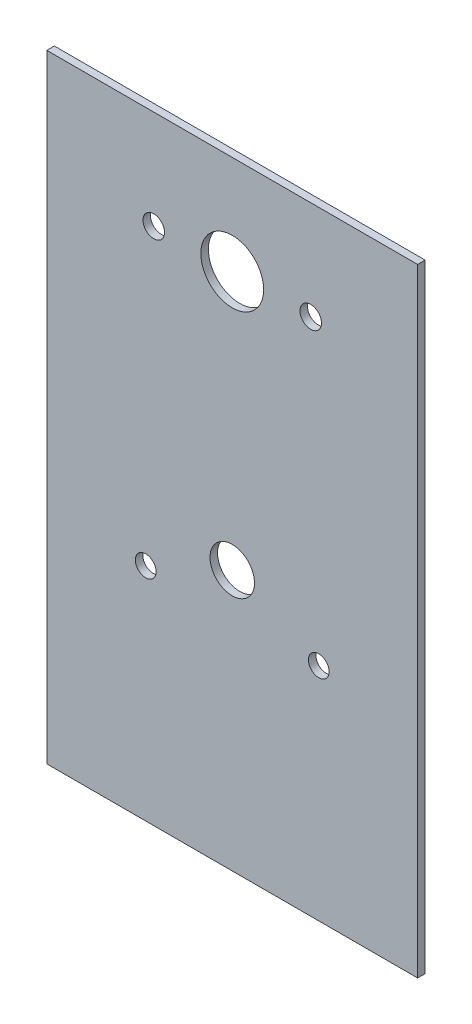
ISO-10303-21;
HEADER;
FILE_DESCRIPTION(('STEP AP214'),'2;1');
FILE_NAME('part.step','',(''),(''),'','','');
FILE_SCHEMA(('AUTOMOTIVE_DESIGN { 1 0 10303 214 1 1 1 1 }'));
ENDSEC;
DATA;
#1=APPLICATION_CONTEXT('core data for automotive mechanical design processes');
#2=APPLICATION_PROTOCOL_DEFINITION('international standard','automotive_design',2000,#1);
#3=PRODUCT_CONTEXT('',#1,'mechanical');
#4=PRODUCT('Part','Part','',(#3));
#5=PRODUCT_RELATED_PRODUCT_CATEGORY('part','',(#4));
#6=PRODUCT_DEFINITION_FORMATION('','',#4);
#7=PRODUCT_DEFINITION_CONTEXT('part definition',#1,'design');
#8=PRODUCT_DEFINITION('design','',#6,#7);
#9=PRODUCT_DEFINITION_SHAPE('','',#8);
#10=(LENGTH_UNIT() NAMED_UNIT(*) SI_UNIT(.MILLI.,.METRE.));
#11=(NAMED_UNIT(*) PLANE_ANGLE_UNIT() SI_UNIT($,.RADIAN.));
#12=(NAMED_UNIT(*) SI_UNIT($,.STERADIAN.) SOLID_ANGLE_UNIT());
#13=UNCERTAINTY_MEASURE_WITH_UNIT(LENGTH_MEASURE(1.E-05),#10,'distance_accuracy_value','');
#14=(GEOMETRIC_REPRESENTATION_CONTEXT(3) GLOBAL_UNCERTAINTY_ASSIGNED_CONTEXT((#13)) GLOBAL_UNIT_ASSIGNED_CONTEXT((#10,
#11,#12)) REPRESENTATION_CONTEXT('',''));
#15=CARTESIAN_POINT('',(0.,0.,0.));
#16=DIRECTION('',(0.,0.,1.));
#17=DIRECTION('',(1.,0.,0.));
#18=AXIS2_PLACEMENT_3D('',#15,#16,#17);
#19=CARTESIAN_POINT('',(37.5,0.,1.524));
#20=DIRECTION('',(1.,0.,0.));
#21=DIRECTION('',(0.,0.,-1.));
#22=AXIS2_PLACEMENT_3D('',#19,#20,#21);
#23=PLANE('',#22);
#24=DIRECTION('',(0.,-1.,0.));
#25=VECTOR('',#24,1.);
#26=CARTESIAN_POINT('',(37.5,0.,0.));
#27=LINE('',#26,#25);
#28=CARTESIAN_POINT('',(37.5,20.,0.));
#29=VERTEX_POINT('',#28);
#30=CARTESIAN_POINT('',(37.5,-105.,0.));
#31=VERTEX_POINT('',#30);
#32=EDGE_CURVE('E121',#29,#31,#27,.T.);
#33=ORIENTED_EDGE('',*,*,#32,.F.);
#34=DIRECTION('',(0.,0.,-1.));
#35=VECTOR('',#34,1.);
#36=CARTESIAN_POINT('',(37.5,20.,1.524));
#37=LINE('',#36,#35);
#38=CARTESIAN_POINT('',(37.5,20.,1.524));
#39=VERTEX_POINT('',#38);
#40=EDGE_CURVE('E11',#39,#29,#37,.T.);
#41=ORIENTED_EDGE('',*,*,#40,.F.);
#42=DIRECTION('',(0.,-1.,0.));
#43=VECTOR('',#42,1.);
#44=CARTESIAN_POINT('',(37.5,0.,1.524));
#45=LINE('',#44,#43);
#46=CARTESIAN_POINT('',(37.5,-105.,1.524));
#47=VERTEX_POINT('',#46);
#48=EDGE_CURVE('E96',#39,#47,#45,.T.);
#49=ORIENTED_EDGE('',*,*,#48,.T.);
#50=DIRECTION('',(0.,0.,-1.));
#51=VECTOR('',#50,1.);
#52=CARTESIAN_POINT('',(37.5,-105.,1.524));
#53=LINE('',#52,#51);
#54=EDGE_CURVE('E75',#47,#31,#53,.T.);
#55=ORIENTED_EDGE('',*,*,#54,.T.);
#56=EDGE_LOOP('',(#33,#41,#49,#55));
#57=FACE_BOUND('',#56,.T.);
#58=ADVANCED_FACE('F35',(#57),#23,.T.);
#59=CARTESIAN_POINT('',(0.,20.,1.524));
#60=DIRECTION('',(0.,1.,0.));
#61=DIRECTION('',(0.,0.,1.));
#62=AXIS2_PLACEMENT_3D('',#59,#60,#61);
#63=PLANE('',#62);
#64=DIRECTION('',(1.,0.,0.));
#65=VECTOR('',#64,1.);
#66=CARTESIAN_POINT('',(0.,20.,0.));
#67=LINE('',#66,#65);
#68=CARTESIAN_POINT('',(-37.5,20.,0.));
#69=VERTEX_POINT('',#68);
#70=EDGE_CURVE('E87',#69,#29,#67,.T.);
#71=ORIENTED_EDGE('',*,*,#70,.F.);
#72=DIRECTION('',(0.,0.,-1.));
#73=VECTOR('',#72,1.);
#74=CARTESIAN_POINT('',(-37.5,20.,1.524));
#75=LINE('',#74,#73);
#76=CARTESIAN_POINT('',(-37.5,20.,1.524));
#77=VERTEX_POINT('',#76);
#78=EDGE_CURVE('E44',#77,#69,#75,.T.);
#79=ORIENTED_EDGE('',*,*,#78,.F.);
#80=DIRECTION('',(1.,0.,0.));
#81=VECTOR('',#80,1.);
#82=CARTESIAN_POINT('',(0.,20.,1.524));
#83=LINE('',#82,#81);
#84=EDGE_CURVE('E85',#77,#39,#83,.T.);
#85=ORIENTED_EDGE('',*,*,#84,.T.);
#86=ORIENTED_EDGE('',*,*,#40,.T.);
#87=EDGE_LOOP('',(#71,#79,#85,#86));
#88=FACE_BOUND('',#87,.T.);
#89=ADVANCED_FACE('F83',(#88),#63,.T.);
#90=CARTESIAN_POINT('',(-37.5,0.,1.524));
#91=DIRECTION('',(1.,0.,0.));
#92=DIRECTION('',(0.,0.,-1.));
#93=AXIS2_PLACEMENT_3D('',#90,#91,#92);
#94=PLANE('',#93);
#95=DIRECTION('',(0.,-1.,0.));
#96=VECTOR('',#95,1.);
#97=CARTESIAN_POINT('',(-37.5,0.,0.));
#98=LINE('',#97,#96);
#99=CARTESIAN_POINT('',(-37.5,-105.,0.));
#100=VERTEX_POINT('',#99);
#101=EDGE_CURVE('E124',#69,#100,#98,.T.);
#102=ORIENTED_EDGE('',*,*,#101,.T.);
#103=DIRECTION('',(0.,0.,-1.));
#104=VECTOR('',#103,1.);
#105=CARTESIAN_POINT('',(-37.5,-105.,1.524));
#106=LINE('',#105,#104);
#107=CARTESIAN_POINT('',(-37.5,-105.,1.524));
#108=VERTEX_POINT('',#107);
#109=EDGE_CURVE('E90',#108,#100,#106,.T.);
#110=ORIENTED_EDGE('',*,*,#109,.F.);
#111=DIRECTION('',(0.,-1.,0.));
#112=VECTOR('',#111,1.);
#113=CARTESIAN_POINT('',(-37.5,0.,1.524));
#114=LINE('',#113,#112);
#115=EDGE_CURVE('E92',#77,#108,#114,.T.);
#116=ORIENTED_EDGE('',*,*,#115,.F.);
#117=ORIENTED_EDGE('',*,*,#78,.T.);
#118=EDGE_LOOP('',(#102,#110,#116,#117));
#119=FACE_BOUND('',#118,.T.);
#120=ADVANCED_FACE('F93',(#119),#94,.F.);
#121=CARTESIAN_POINT('',(15.875,0.,1.524));
#122=DIRECTION('',(0.,0.,-1.));
#123=DIRECTION('',(-1.,0.,0.));
#124=AXIS2_PLACEMENT_3D('',#121,#122,#123);
#125=CYLINDRICAL_SURFACE('',#124,2.1828125);
#126=CARTESIAN_POINT('',(15.875,0.,1.524));
#127=DIRECTION('',(0.,0.,1.));
#128=DIRECTION('',(1.,0.,0.));
#129=AXIS2_PLACEMENT_3D('',#126,#127,#128);
#130=CIRCLE('',#129,2.1828125);
#131=CARTESIAN_POINT('',(18.0578125,0.,1.524));
#132=VERTEX_POINT('',#131);
#133=EDGE_CURVE('E98',#132,#132,#130,.T.);
#134=ORIENTED_EDGE('',*,*,#133,.T.);
#135=EDGE_LOOP('',(#134));
#136=FACE_BOUND('',#135,.T.);
#137=CARTESIAN_POINT('',(15.875,0.,0.));
#138=DIRECTION('',(0.,0.,1.));
#139=DIRECTION('',(1.,0.,0.));
#140=AXIS2_PLACEMENT_3D('',#137,#138,#139);
#141=CIRCLE('',#140,2.1828125);
#142=CARTESIAN_POINT('',(18.0578125,0.,0.));
#143=VERTEX_POINT('',#142);
#144=EDGE_CURVE('E118',#143,#143,#141,.T.);
#145=ORIENTED_EDGE('',*,*,#144,.F.);
#146=EDGE_LOOP('',(#145));
#147=FACE_BOUND('',#146,.T.);
#148=ADVANCED_FACE('F140',(#136,#147),#125,.F.);
#149=CARTESIAN_POINT('',(-15.875,0.,1.524));
#150=DIRECTION('',(0.,0.,-1.));
#151=DIRECTION('',(-1.,0.,0.));
#152=AXIS2_PLACEMENT_3D('',#149,#150,#151);
#153=CYLINDRICAL_SURFACE('',#152,2.1828125);
#154=CARTESIAN_POINT('',(-15.875,0.,1.524));
#155=DIRECTION('',(0.,0.,1.));
#156=DIRECTION('',(1.,0.,0.));
#157=AXIS2_PLACEMENT_3D('',#154,#155,#156);
#158=CIRCLE('',#157,2.1828125);
#159=CARTESIAN_POINT('',(-13.6921875,0.,1.524));
#160=VERTEX_POINT('',#159);
#161=EDGE_CURVE('E274',#160,#160,#158,.T.);
#162=ORIENTED_EDGE('',*,*,#161,.T.);
#163=EDGE_LOOP('',(#162));
#164=FACE_BOUND('',#163,.T.);
#165=CARTESIAN_POINT('',(-15.875,0.,0.));
#166=DIRECTION('',(0.,0.,1.));
#167=DIRECTION('',(1.,0.,0.));
#168=AXIS2_PLACEMENT_3D('',#165,#166,#167);
#169=CIRCLE('',#168,2.1828125);
#170=CARTESIAN_POINT('',(-13.6921875,0.,0.));
#171=VERTEX_POINT('',#170);
#172=EDGE_CURVE('E115',#171,#171,#169,.T.);
#173=ORIENTED_EDGE('',*,*,#172,.F.);
#174=EDGE_LOOP('',(#173));
#175=FACE_BOUND('',#174,.T.);
#176=ADVANCED_FACE('F143',(#164,#175),#153,.F.);
#177=CARTESIAN_POINT('',(17.5,-60.299124508107,1.524));
#178=DIRECTION('',(0.,0.,-1.));
#179=DIRECTION('',(-1.,0.,0.));
#180=AXIS2_PLACEMENT_3D('',#177,#178,#179);
#181=CYLINDRICAL_SURFACE('',#180,2.1);
#182=CARTESIAN_POINT('',(17.5,-60.299124508107,1.524));
#183=DIRECTION('',(0.,0.,1.));
#184=DIRECTION('',(1.,0.,0.));
#185=AXIS2_PLACEMENT_3D('',#182,#183,#184);
#186=CIRCLE('',#185,2.1);
#187=CARTESIAN_POINT('',(19.6,-60.299124508107,1.524));
#188=VERTEX_POINT('',#187);
#189=EDGE_CURVE('E270',#188,#188,#186,.T.);
#190=ORIENTED_EDGE('',*,*,#189,.T.);
#191=EDGE_LOOP('',(#190));
#192=FACE_BOUND('',#191,.T.);
#193=CARTESIAN_POINT('',(17.5,-60.299124508107,0.));
#194=DIRECTION('',(0.,0.,1.));
#195=DIRECTION('',(1.,0.,0.));
#196=AXIS2_PLACEMENT_3D('',#193,#194,#195);
#197=CIRCLE('',#196,2.1);
#198=CARTESIAN_POINT('',(19.6,-60.299124508107,0.));
#199=VERTEX_POINT('',#198);
#200=EDGE_CURVE('E112',#199,#199,#197,.T.);
#201=ORIENTED_EDGE('',*,*,#200,.F.);
#202=EDGE_LOOP('',(#201));
#203=FACE_BOUND('',#202,.T.);
#204=ADVANCED_FACE('F147',(#192,#203),#181,.F.);
#205=CARTESIAN_POINT('',(-17.5,-60.299124508107,1.524));
#206=DIRECTION('',(0.,0.,-1.));
#207=DIRECTION('',(-1.,0.,0.));
#208=AXIS2_PLACEMENT_3D('',#205,#206,#207);
#209=CYLINDRICAL_SURFACE('',#208,2.1);
#210=CARTESIAN_POINT('',(-17.5,-60.299124508107,1.524));
#211=DIRECTION('',(0.,0.,1.));
#212=DIRECTION('',(1.,0.,0.));
#213=AXIS2_PLACEMENT_3D('',#210,#211,#212);
#214=CIRCLE('',#213,2.1);
#215=CARTESIAN_POINT('',(-15.4,-60.299124508107,1.524));
#216=VERTEX_POINT('',#215);
#217=EDGE_CURVE('E266',#216,#216,#214,.T.);
#218=ORIENTED_EDGE('',*,*,#217,.T.);
#219=EDGE_LOOP('',(#218));
#220=FACE_BOUND('',#219,.T.);
#221=CARTESIAN_POINT('',(-17.5,-60.299124508107,0.));
#222=DIRECTION('',(0.,0.,1.));
#223=DIRECTION('',(1.,0.,0.));
#224=AXIS2_PLACEMENT_3D('',#221,#222,#223);
#225=CIRCLE('',#224,2.1);
#226=CARTESIAN_POINT('',(-15.4,-60.299124508107,0.));
#227=VERTEX_POINT('',#226);
#228=EDGE_CURVE('E109',#227,#227,#225,.T.);
#229=ORIENTED_EDGE('',*,*,#228,.F.);
#230=EDGE_LOOP('',(#229));
#231=FACE_BOUND('',#230,.T.);
#232=ADVANCED_FACE('F151',(#220,#231),#209,.F.);
#233=CARTESIAN_POINT('',(0.,0.,1.524));
#234=DIRECTION('',(0.,0.,-1.));
#235=DIRECTION('',(-1.,0.,0.));
#236=AXIS2_PLACEMENT_3D('',#233,#234,#235);
#237=CYLINDRICAL_SURFACE('',#236,6.35);
#238=CARTESIAN_POINT('',(0.,0.,1.524));
#239=DIRECTION('',(0.,0.,1.));
#240=DIRECTION('',(1.,0.,0.));
#241=AXIS2_PLACEMENT_3D('',#238,#239,#240);
#242=CIRCLE('',#241,6.35);
#243=CARTESIAN_POINT('',(6.35,0.,1.524));
#244=VERTEX_POINT('',#243);
#245=EDGE_CURVE('E165',#244,#244,#242,.T.);
#246=ORIENTED_EDGE('',*,*,#245,.T.);
#247=EDGE_LOOP('',(#246));
#248=FACE_BOUND('',#247,.T.);
#249=CARTESIAN_POINT('',(0.,0.,0.));
#250=DIRECTION('',(0.,0.,1.));
#251=DIRECTION('',(1.,0.,0.));
#252=AXIS2_PLACEMENT_3D('',#249,#250,#251);
#253=CIRCLE('',#252,6.35);
#254=CARTESIAN_POINT('',(6.35,0.,0.));
#255=VERTEX_POINT('',#254);
#256=EDGE_CURVE('E106',#255,#255,#253,.T.);
#257=ORIENTED_EDGE('',*,*,#256,.F.);
#258=EDGE_LOOP('',(#257));
#259=FACE_BOUND('',#258,.T.);
#260=ADVANCED_FACE('F154',(#248,#259),#237,.F.);
#261=CARTESIAN_POINT('',(0.,-52.299124508107,1.524));
#262=DIRECTION('',(0.,0.,-1.));
#263=DIRECTION('',(-1.,0.,0.));
#264=AXIS2_PLACEMENT_3D('',#261,#262,#263);
#265=CYLINDRICAL_SURFACE('',#264,4.5);
#266=CARTESIAN_POINT('',(0.,-52.299124508107,1.524));
#267=DIRECTION('',(0.,0.,1.));
#268=DIRECTION('',(1.,0.,0.));
#269=AXIS2_PLACEMENT_3D('',#266,#267,#268);
#270=CIRCLE('',#269,4.5);
#271=CARTESIAN_POINT('',(4.5,-52.299124508107,1.524));
#272=VERTEX_POINT('',#271);
#273=EDGE_CURVE('E127',#272,#272,#270,.T.);
#274=ORIENTED_EDGE('',*,*,#273,.T.);
#275=EDGE_LOOP('',(#274));
#276=FACE_BOUND('',#275,.T.);
#277=CARTESIAN_POINT('',(0.,-52.299124508107,0.));
#278=DIRECTION('',(0.,0.,1.));
#279=DIRECTION('',(1.,0.,0.));
#280=AXIS2_PLACEMENT_3D('',#277,#278,#279);
#281=CIRCLE('',#280,4.5);
#282=CARTESIAN_POINT('',(4.5,-52.299124508107,0.));
#283=VERTEX_POINT('',#282);
#284=EDGE_CURVE('E103',#283,#283,#281,.T.);
#285=ORIENTED_EDGE('',*,*,#284,.F.);
#286=EDGE_LOOP('',(#285));
#287=FACE_BOUND('',#286,.T.);
#288=ADVANCED_FACE('F37',(#276,#287),#265,.F.);
#289=CARTESIAN_POINT('',(0.,-105.,1.524));
#290=DIRECTION('',(0.,1.,0.));
#291=DIRECTION('',(0.,0.,1.));
#292=AXIS2_PLACEMENT_3D('',#289,#290,#291);
#293=PLANE('',#292);
#294=DIRECTION('',(1.,0.,0.));
#295=VECTOR('',#294,1.);
#296=CARTESIAN_POINT('',(0.,-105.,0.));
#297=LINE('',#296,#295);
#298=EDGE_CURVE('E68',#100,#31,#297,.T.);
#299=ORIENTED_EDGE('',*,*,#298,.T.);
#300=ORIENTED_EDGE('',*,*,#54,.F.);
#301=DIRECTION('',(1.,0.,0.));
#302=VECTOR('',#301,1.);
#303=CARTESIAN_POINT('',(0.,-105.,1.524));
#304=LINE('',#303,#302);
#305=EDGE_CURVE('E52',#108,#47,#304,.T.);
#306=ORIENTED_EDGE('',*,*,#305,.F.);
#307=ORIENTED_EDGE('',*,*,#109,.T.);
#308=EDGE_LOOP('',(#299,#300,#306,#307));
#309=FACE_BOUND('',#308,.T.);
#310=ADVANCED_FACE('F130',(#309),#293,.F.);
#311=CARTESIAN_POINT('',(0.,0.,1.524));
#312=DIRECTION('',(0.,0.,1.));
#313=DIRECTION('',(1.,0.,0.));
#314=AXIS2_PLACEMENT_3D('',#311,#312,#313);
#315=PLANE('',#314);
#316=ORIENTED_EDGE('',*,*,#273,.F.);
#317=EDGE_LOOP('',(#316));
#318=FACE_BOUND('',#317,.T.);
#319=ORIENTED_EDGE('',*,*,#245,.F.);
#320=EDGE_LOOP('',(#319));
#321=FACE_BOUND('',#320,.T.);
#322=ORIENTED_EDGE('',*,*,#217,.F.);
#323=EDGE_LOOP('',(#322));
#324=FACE_BOUND('',#323,.T.);
#325=ORIENTED_EDGE('',*,*,#189,.F.);
#326=EDGE_LOOP('',(#325));
#327=FACE_BOUND('',#326,.T.);
#328=ORIENTED_EDGE('',*,*,#161,.F.);
#329=EDGE_LOOP('',(#328));
#330=FACE_BOUND('',#329,.T.);
#331=ORIENTED_EDGE('',*,*,#133,.F.);
#332=EDGE_LOOP('',(#331));
#333=FACE_BOUND('',#332,.T.);
#334=ORIENTED_EDGE('',*,*,#48,.F.);
#335=ORIENTED_EDGE('',*,*,#84,.F.);
#336=ORIENTED_EDGE('',*,*,#115,.T.);
#337=ORIENTED_EDGE('',*,*,#305,.T.);
#338=EDGE_LOOP('',(#334,#335,#336,#337));
#339=FACE_BOUND('',#338,.T.);
#340=ADVANCED_FACE('F95',(#318,#321,#324,#327,#330,#333,#339),#315,.T.);
#341=CARTESIAN_POINT('',(0.,0.,0.));
#342=DIRECTION('',(0.,0.,1.));
#343=DIRECTION('',(1.,0.,0.));
#344=AXIS2_PLACEMENT_3D('',#341,#342,#343);
#345=PLANE('',#344);
#346=ORIENTED_EDGE('',*,*,#284,.T.);
#347=EDGE_LOOP('',(#346));
#348=FACE_BOUND('',#347,.T.);
#349=ORIENTED_EDGE('',*,*,#256,.T.);
#350=EDGE_LOOP('',(#349));
#351=FACE_BOUND('',#350,.T.);
#352=ORIENTED_EDGE('',*,*,#228,.T.);
#353=EDGE_LOOP('',(#352));
#354=FACE_BOUND('',#353,.T.);
#355=ORIENTED_EDGE('',*,*,#200,.T.);
#356=EDGE_LOOP('',(#355));
#357=FACE_BOUND('',#356,.T.);
#358=ORIENTED_EDGE('',*,*,#172,.T.);
#359=EDGE_LOOP('',(#358));
#360=FACE_BOUND('',#359,.T.);
#361=ORIENTED_EDGE('',*,*,#144,.T.);
#362=EDGE_LOOP('',(#361));
#363=FACE_BOUND('',#362,.T.);
#364=ORIENTED_EDGE('',*,*,#32,.T.);
#365=ORIENTED_EDGE('',*,*,#298,.F.);
#366=ORIENTED_EDGE('',*,*,#101,.F.);
#367=ORIENTED_EDGE('',*,*,#70,.T.);
#368=EDGE_LOOP('',(#364,#365,#366,#367));
#369=FACE_BOUND('',#368,.T.);
#370=ADVANCED_FACE('F131',(#348,#351,#354,#357,#360,#363,#369),#345,.F.);
#371=CLOSED_SHELL('',(#58,#89,#120,#148,#176,#204,#232,#260,#288,#310,#340,#370));
#372=MANIFOLD_SOLID_BREP('B2',#371);
#373=ADVANCED_BREP_SHAPE_REPRESENTATION('',(#18,#372),#14);
#374=SHAPE_DEFINITION_REPRESENTATION(#9,#373);
ENDSEC;
END-ISO-10303-21;
